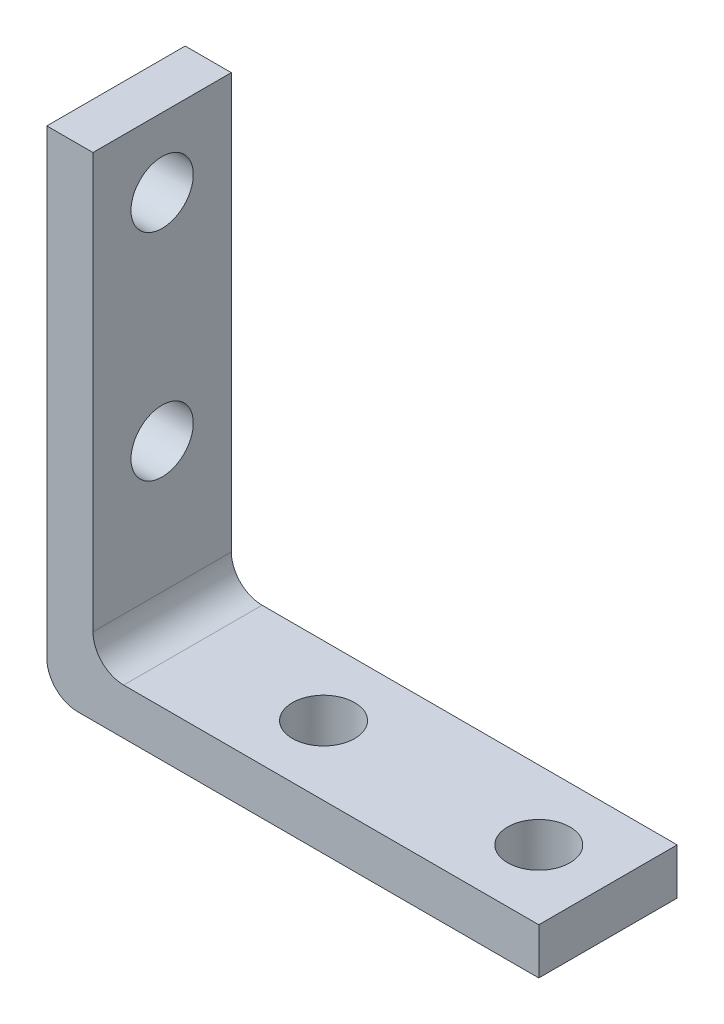
ISO-10303-21;
HEADER;
FILE_DESCRIPTION(('STEP AP214'),'2;1');
FILE_NAME('part.step','',(''),(''),'','','');
FILE_SCHEMA(('AUTOMOTIVE_DESIGN { 1 0 10303 214 1 1 1 1 }'));
ENDSEC;
DATA;
#1=APPLICATION_CONTEXT('core data for automotive mechanical design processes');
#2=APPLICATION_PROTOCOL_DEFINITION('international standard','automotive_design',2000,#1);
#3=PRODUCT_CONTEXT('',#1,'mechanical');
#4=PRODUCT('Part','Part','',(#3));
#5=PRODUCT_RELATED_PRODUCT_CATEGORY('part','',(#4));
#6=PRODUCT_DEFINITION_FORMATION('','',#4);
#7=PRODUCT_DEFINITION_CONTEXT('part definition',#1,'design');
#8=PRODUCT_DEFINITION('design','',#6,#7);
#9=PRODUCT_DEFINITION_SHAPE('','',#8);
#10=(LENGTH_UNIT() NAMED_UNIT(*) SI_UNIT(.MILLI.,.METRE.));
#11=(NAMED_UNIT(*) PLANE_ANGLE_UNIT() SI_UNIT($,.RADIAN.));
#12=(NAMED_UNIT(*) SI_UNIT($,.STERADIAN.) SOLID_ANGLE_UNIT());
#13=UNCERTAINTY_MEASURE_WITH_UNIT(LENGTH_MEASURE(1.E-05),#10,'distance_accuracy_value','');
#14=(GEOMETRIC_REPRESENTATION_CONTEXT(3) GLOBAL_UNCERTAINTY_ASSIGNED_CONTEXT((#13)) GLOBAL_UNIT_ASSIGNED_CONTEXT((#10,
#11,#12)) REPRESENTATION_CONTEXT('',''));
#15=CARTESIAN_POINT('',(0.,0.,0.));
#16=DIRECTION('',(0.,0.,1.));
#17=DIRECTION('',(1.,0.,0.));
#18=AXIS2_PLACEMENT_3D('',#15,#16,#17);
#19=CARTESIAN_POINT('',(0.,0.,4.5));
#20=DIRECTION('',(-1.,0.,0.));
#21=DIRECTION('',(0.,0.,1.));
#22=AXIS2_PLACEMENT_3D('',#19,#20,#21);
#23=PLANE('',#22);
#24=CARTESIAN_POINT('',(0.,27.5,0.));
#25=DIRECTION('',(-1.,0.,0.));
#26=DIRECTION('',(0.,0.,1.));
#27=AXIS2_PLACEMENT_3D('',#24,#25,#26);
#28=CIRCLE('',#27,2.025);
#29=CARTESIAN_POINT('',(0.,27.5,2.025));
#30=VERTEX_POINT('',#29);
#31=EDGE_CURVE('E192',#30,#30,#28,.T.);
#32=ORIENTED_EDGE('',*,*,#31,.F.);
#33=EDGE_LOOP('',(#32));
#34=FACE_BOUND('',#33,.T.);
#35=CARTESIAN_POINT('',(0.,13.5,0.));
#36=DIRECTION('',(-1.,0.,0.));
#37=DIRECTION('',(0.,0.,1.));
#38=AXIS2_PLACEMENT_3D('',#35,#36,#37);
#39=CIRCLE('',#38,2.025);
#40=CARTESIAN_POINT('',(0.,13.5,2.025));
#41=VERTEX_POINT('',#40);
#42=EDGE_CURVE('E285',#41,#41,#39,.T.);
#43=ORIENTED_EDGE('',*,*,#42,.F.);
#44=EDGE_LOOP('',(#43));
#45=FACE_BOUND('',#44,.T.);
#46=DIRECTION('',(0.,1.,0.));
#47=VECTOR('',#46,1.);
#48=CARTESIAN_POINT('',(0.,0.,-4.5));
#49=LINE('',#48,#47);
#50=CARTESIAN_POINT('',(0.,2.,-4.5));
#51=VERTEX_POINT('',#50);
#52=CARTESIAN_POINT('',(0.,32.,-4.5));
#53=VERTEX_POINT('',#52);
#54=EDGE_CURVE('E152',#51,#53,#49,.T.);
#55=ORIENTED_EDGE('',*,*,#54,.F.);
#56=DIRECTION('',(0.,0.,-1.));
#57=VECTOR('',#56,1.);
#58=CARTESIAN_POINT('',(0.,2.,4.5));
#59=LINE('',#58,#57);
#60=CARTESIAN_POINT('',(0.,2.,4.5));
#61=VERTEX_POINT('',#60);
#62=EDGE_CURVE('E58',#51,#61,#59,.F.);
#63=ORIENTED_EDGE('',*,*,#62,.T.);
#64=DIRECTION('',(0.,1.,0.));
#65=VECTOR('',#64,1.);
#66=CARTESIAN_POINT('',(0.,0.,4.5));
#67=LINE('',#66,#65);
#68=CARTESIAN_POINT('',(0.,32.,4.5));
#69=VERTEX_POINT('',#68);
#70=EDGE_CURVE('E120',#61,#69,#67,.T.);
#71=ORIENTED_EDGE('',*,*,#70,.T.);
#72=DIRECTION('',(0.,0.,-1.));
#73=VECTOR('',#72,1.);
#74=CARTESIAN_POINT('',(0.,32.,4.5));
#75=LINE('',#74,#73);
#76=EDGE_CURVE('E151',#69,#53,#75,.T.);
#77=ORIENTED_EDGE('',*,*,#76,.T.);
#78=EDGE_LOOP('',(#55,#63,#71,#77));
#79=FACE_BOUND('',#78,.T.);
#80=ADVANCED_FACE('F42',(#34,#45,#79),#23,.T.);
#81=CARTESIAN_POINT('',(0.,0.,4.5));
#82=DIRECTION('',(0.,1.,0.));
#83=DIRECTION('',(0.,0.,1.));
#84=AXIS2_PLACEMENT_3D('',#81,#82,#83);
#85=PLANE('',#84);
#86=CARTESIAN_POINT('',(13.5,0.,0.));
#87=DIRECTION('',(0.,-1.,0.));
#88=DIRECTION('',(0.,0.,-1.));
#89=AXIS2_PLACEMENT_3D('',#86,#87,#88);
#90=CIRCLE('',#89,2.025);
#91=CARTESIAN_POINT('',(13.5,0.,-2.025));
#92=VERTEX_POINT('',#91);
#93=EDGE_CURVE('E184',#92,#92,#90,.T.);
#94=ORIENTED_EDGE('',*,*,#93,.F.);
#95=EDGE_LOOP('',(#94));
#96=FACE_BOUND('',#95,.T.);
#97=CARTESIAN_POINT('',(27.5,0.,0.));
#98=DIRECTION('',(0.,-1.,0.));
#99=DIRECTION('',(0.,0.,-1.));
#100=AXIS2_PLACEMENT_3D('',#97,#98,#99);
#101=CIRCLE('',#100,2.025);
#102=CARTESIAN_POINT('',(27.5,0.,-2.025));
#103=VERTEX_POINT('',#102);
#104=EDGE_CURVE('E196',#103,#103,#101,.T.);
#105=ORIENTED_EDGE('',*,*,#104,.F.);
#106=EDGE_LOOP('',(#105));
#107=FACE_BOUND('',#106,.T.);
#108=DIRECTION('',(1.,0.,0.));
#109=VECTOR('',#108,1.);
#110=CARTESIAN_POINT('',(0.,0.,4.5));
#111=LINE('',#110,#109);
#112=CARTESIAN_POINT('',(2.,0.,4.5));
#113=VERTEX_POINT('',#112);
#114=CARTESIAN_POINT('',(32.,0.,4.5));
#115=VERTEX_POINT('',#114);
#116=EDGE_CURVE('E107',#113,#115,#111,.T.);
#117=ORIENTED_EDGE('',*,*,#116,.F.);
#118=DIRECTION('',(0.,0.,-1.));
#119=VECTOR('',#118,1.);
#120=CARTESIAN_POINT('',(2.,0.,-4.5));
#121=LINE('',#120,#119);
#122=CARTESIAN_POINT('',(2.,0.,-4.5));
#123=VERTEX_POINT('',#122);
#124=EDGE_CURVE('E203',#113,#123,#121,.T.);
#125=ORIENTED_EDGE('',*,*,#124,.T.);
#126=DIRECTION('',(1.,0.,0.));
#127=VECTOR('',#126,1.);
#128=CARTESIAN_POINT('',(0.,0.,-4.5));
#129=LINE('',#128,#127);
#130=CARTESIAN_POINT('',(32.,0.,-4.5));
#131=VERTEX_POINT('',#130);
#132=EDGE_CURVE('E125',#123,#131,#129,.T.);
#133=ORIENTED_EDGE('',*,*,#132,.T.);
#134=DIRECTION('',(0.,0.,-1.));
#135=VECTOR('',#134,1.);
#136=CARTESIAN_POINT('',(32.,0.,4.5));
#137=LINE('',#136,#135);
#138=EDGE_CURVE('E123',#115,#131,#137,.T.);
#139=ORIENTED_EDGE('',*,*,#138,.F.);
#140=EDGE_LOOP('',(#117,#125,#133,#139));
#141=FACE_BOUND('',#140,.T.);
#142=ADVANCED_FACE('F124',(#96,#107,#141),#85,.F.);
#143=CARTESIAN_POINT('',(32.,0.,4.5));
#144=DIRECTION('',(-1.,0.,0.));
#145=DIRECTION('',(0.,0.,1.));
#146=AXIS2_PLACEMENT_3D('',#143,#144,#145);
#147=PLANE('',#146);
#148=DIRECTION('',(0.,1.,0.));
#149=VECTOR('',#148,1.);
#150=CARTESIAN_POINT('',(32.,0.,-4.5));
#151=LINE('',#150,#149);
#152=CARTESIAN_POINT('',(32.,3.,-4.5));
#153=VERTEX_POINT('',#152);
#154=EDGE_CURVE('E158',#131,#153,#151,.T.);
#155=ORIENTED_EDGE('',*,*,#154,.T.);
#156=DIRECTION('',(0.,0.,-1.));
#157=VECTOR('',#156,1.);
#158=CARTESIAN_POINT('',(32.,3.,4.5));
#159=LINE('',#158,#157);
#160=CARTESIAN_POINT('',(32.,3.,4.5));
#161=VERTEX_POINT('',#160);
#162=EDGE_CURVE('E131',#161,#153,#159,.T.);
#163=ORIENTED_EDGE('',*,*,#162,.F.);
#164=DIRECTION('',(0.,1.,0.));
#165=VECTOR('',#164,1.);
#166=CARTESIAN_POINT('',(32.,0.,4.5));
#167=LINE('',#166,#165);
#168=EDGE_CURVE('E112',#115,#161,#167,.T.);
#169=ORIENTED_EDGE('',*,*,#168,.F.);
#170=ORIENTED_EDGE('',*,*,#138,.T.);
#171=EDGE_LOOP('',(#155,#163,#169,#170));
#172=FACE_BOUND('',#171,.T.);
#173=ADVANCED_FACE('F133',(#172),#147,.F.);
#174=CARTESIAN_POINT('',(0.,3.,4.5));
#175=DIRECTION('',(0.,1.,0.));
#176=DIRECTION('',(0.,0.,1.));
#177=AXIS2_PLACEMENT_3D('',#174,#175,#176);
#178=PLANE('',#177);
#179=CARTESIAN_POINT('',(13.5,3.,0.));
#180=DIRECTION('',(0.,1.,0.));
#181=DIRECTION('',(0.,0.,1.));
#182=AXIS2_PLACEMENT_3D('',#179,#180,#181);
#183=CIRCLE('',#182,2.025);
#184=CARTESIAN_POINT('',(13.5,3.,2.025));
#185=VERTEX_POINT('',#184);
#186=EDGE_CURVE('E155',#185,#185,#183,.T.);
#187=ORIENTED_EDGE('',*,*,#186,.F.);
#188=EDGE_LOOP('',(#187));
#189=FACE_BOUND('',#188,.T.);
#190=CARTESIAN_POINT('',(27.5,3.,0.));
#191=DIRECTION('',(0.,1.,0.));
#192=DIRECTION('',(0.,0.,1.));
#193=AXIS2_PLACEMENT_3D('',#190,#191,#192);
#194=CIRCLE('',#193,2.025);
#195=CARTESIAN_POINT('',(27.5,3.,2.025));
#196=VERTEX_POINT('',#195);
#197=EDGE_CURVE('E180',#196,#196,#194,.T.);
#198=ORIENTED_EDGE('',*,*,#197,.F.);
#199=EDGE_LOOP('',(#198));
#200=FACE_BOUND('',#199,.T.);
#201=DIRECTION('',(1.,0.,0.));
#202=VECTOR('',#201,1.);
#203=CARTESIAN_POINT('',(0.,3.,-4.5));
#204=LINE('',#203,#202);
#205=CARTESIAN_POINT('',(5.,3.,-4.5));
#206=VERTEX_POINT('',#205);
#207=EDGE_CURVE('E161',#206,#153,#204,.T.);
#208=ORIENTED_EDGE('',*,*,#207,.F.);
#209=DIRECTION('',(0.,0.,-1.));
#210=VECTOR('',#209,1.);
#211=CARTESIAN_POINT('',(5.,3.,4.5));
#212=LINE('',#211,#210);
#213=CARTESIAN_POINT('',(5.,3.,4.5));
#214=VERTEX_POINT('',#213);
#215=EDGE_CURVE('E200',#206,#214,#212,.F.);
#216=ORIENTED_EDGE('',*,*,#215,.T.);
#217=DIRECTION('',(1.,0.,0.));
#218=VECTOR('',#217,1.);
#219=CARTESIAN_POINT('',(0.,3.,4.5));
#220=LINE('',#219,#218);
#221=EDGE_CURVE('E136',#214,#161,#220,.T.);
#222=ORIENTED_EDGE('',*,*,#221,.T.);
#223=ORIENTED_EDGE('',*,*,#162,.T.);
#224=EDGE_LOOP('',(#208,#216,#222,#223));
#225=FACE_BOUND('',#224,.T.);
#226=ADVANCED_FACE('F219',(#189,#200,#225),#178,.T.);
#227=CARTESIAN_POINT('',(3.,0.,4.5));
#228=DIRECTION('',(-1.,0.,0.));
#229=DIRECTION('',(0.,0.,1.));
#230=AXIS2_PLACEMENT_3D('',#227,#228,#229);
#231=PLANE('',#230);
#232=CARTESIAN_POINT('',(3.,27.5,0.));
#233=DIRECTION('',(-1.,0.,0.));
#234=DIRECTION('',(0.,0.,1.));
#235=AXIS2_PLACEMENT_3D('',#232,#233,#234);
#236=CIRCLE('',#235,2.025);
#237=CARTESIAN_POINT('',(3.,27.5,2.025));
#238=VERTEX_POINT('',#237);
#239=EDGE_CURVE('E191',#238,#238,#236,.T.);
#240=ORIENTED_EDGE('',*,*,#239,.T.);
#241=EDGE_LOOP('',(#240));
#242=FACE_BOUND('',#241,.T.);
#243=CARTESIAN_POINT('',(3.,13.5,0.));
#244=DIRECTION('',(-1.,0.,0.));
#245=DIRECTION('',(0.,0.,1.));
#246=AXIS2_PLACEMENT_3D('',#243,#244,#245);
#247=CIRCLE('',#246,2.025);
#248=CARTESIAN_POINT('',(3.,13.5,2.025));
#249=VERTEX_POINT('',#248);
#250=EDGE_CURVE('E188',#249,#249,#247,.T.);
#251=ORIENTED_EDGE('',*,*,#250,.T.);
#252=EDGE_LOOP('',(#251));
#253=FACE_BOUND('',#252,.T.);
#254=DIRECTION('',(0.,1.,0.));
#255=VECTOR('',#254,1.);
#256=CARTESIAN_POINT('',(3.,0.,4.5));
#257=LINE('',#256,#255);
#258=CARTESIAN_POINT('',(3.,5.,4.5));
#259=VERTEX_POINT('',#258);
#260=CARTESIAN_POINT('',(3.,32.,4.5));
#261=VERTEX_POINT('',#260);
#262=EDGE_CURVE('E141',#259,#261,#257,.T.);
#263=ORIENTED_EDGE('',*,*,#262,.F.);
#264=DIRECTION('',(0.,0.,-1.));
#265=VECTOR('',#264,1.);
#266=CARTESIAN_POINT('',(3.,5.,4.5));
#267=LINE('',#266,#265);
#268=CARTESIAN_POINT('',(3.,5.,-4.5));
#269=VERTEX_POINT('',#268);
#270=EDGE_CURVE('E130',#259,#269,#267,.T.);
#271=ORIENTED_EDGE('',*,*,#270,.T.);
#272=DIRECTION('',(0.,1.,0.));
#273=VECTOR('',#272,1.);
#274=CARTESIAN_POINT('',(3.,0.,-4.5));
#275=LINE('',#274,#273);
#276=CARTESIAN_POINT('',(3.,32.,-4.5));
#277=VERTEX_POINT('',#276);
#278=EDGE_CURVE('E164',#269,#277,#275,.T.);
#279=ORIENTED_EDGE('',*,*,#278,.T.);
#280=DIRECTION('',(0.,0.,-1.));
#281=VECTOR('',#280,1.);
#282=CARTESIAN_POINT('',(3.,32.,4.5));
#283=LINE('',#282,#281);
#284=EDGE_CURVE('E174',#261,#277,#283,.T.);
#285=ORIENTED_EDGE('',*,*,#284,.F.);
#286=EDGE_LOOP('',(#263,#271,#279,#285));
#287=FACE_BOUND('',#286,.T.);
#288=ADVANCED_FACE('F226',(#242,#253,#287),#231,.F.);
#289=CARTESIAN_POINT('',(0.,32.,4.5));
#290=DIRECTION('',(0.,1.,0.));
#291=DIRECTION('',(0.,0.,1.));
#292=AXIS2_PLACEMENT_3D('',#289,#290,#291);
#293=PLANE('',#292);
#294=DIRECTION('',(1.,0.,0.));
#295=VECTOR('',#294,1.);
#296=CARTESIAN_POINT('',(0.,32.,-4.5));
#297=LINE('',#296,#295);
#298=EDGE_CURVE('E167',#53,#277,#297,.T.);
#299=ORIENTED_EDGE('',*,*,#298,.F.);
#300=ORIENTED_EDGE('',*,*,#76,.F.);
#301=DIRECTION('',(1.,0.,0.));
#302=VECTOR('',#301,1.);
#303=CARTESIAN_POINT('',(0.,32.,4.5));
#304=LINE('',#303,#302);
#305=EDGE_CURVE('E147',#69,#261,#304,.T.);
#306=ORIENTED_EDGE('',*,*,#305,.T.);
#307=ORIENTED_EDGE('',*,*,#284,.T.);
#308=EDGE_LOOP('',(#299,#300,#306,#307));
#309=FACE_BOUND('',#308,.T.);
#310=ADVANCED_FACE('F230',(#309),#293,.T.);
#311=CARTESIAN_POINT('',(0.,0.,4.5));
#312=DIRECTION('',(0.,0.,1.));
#313=DIRECTION('',(1.,0.,0.));
#314=AXIS2_PLACEMENT_3D('',#311,#312,#313);
#315=PLANE('',#314);
#316=ORIENTED_EDGE('',*,*,#70,.F.);
#317=CARTESIAN_POINT('',(2.,2.,4.5));
#318=DIRECTION('',(0.,0.,1.));
#319=DIRECTION('',(1.,0.,0.));
#320=AXIS2_PLACEMENT_3D('',#317,#318,#319);
#321=CIRCLE('',#320,2.);
#322=EDGE_CURVE('E115',#61,#113,#321,.T.);
#323=ORIENTED_EDGE('',*,*,#322,.T.);
#324=ORIENTED_EDGE('',*,*,#116,.T.);
#325=ORIENTED_EDGE('',*,*,#168,.T.);
#326=ORIENTED_EDGE('',*,*,#221,.F.);
#327=CARTESIAN_POINT('',(5.,5.,4.5));
#328=DIRECTION('',(0.,0.,1.));
#329=DIRECTION('',(1.,0.,0.));
#330=AXIS2_PLACEMENT_3D('',#327,#328,#329);
#331=CIRCLE('',#330,2.);
#332=EDGE_CURVE('E11',#214,#259,#331,.F.);
#333=ORIENTED_EDGE('',*,*,#332,.T.);
#334=ORIENTED_EDGE('',*,*,#262,.T.);
#335=ORIENTED_EDGE('',*,*,#305,.F.);
#336=EDGE_LOOP('',(#316,#323,#324,#325,#326,#333,#334,#335));
#337=FACE_BOUND('',#336,.T.);
#338=ADVANCED_FACE('F109',(#337),#315,.T.);
#339=CARTESIAN_POINT('',(0.,0.,-4.5));
#340=DIRECTION('',(0.,0.,1.));
#341=DIRECTION('',(1.,0.,0.));
#342=AXIS2_PLACEMENT_3D('',#339,#340,#341);
#343=PLANE('',#342);
#344=ORIENTED_EDGE('',*,*,#132,.F.);
#345=CARTESIAN_POINT('',(2.,2.,-4.5));
#346=DIRECTION('',(0.,0.,1.));
#347=DIRECTION('',(1.,0.,0.));
#348=AXIS2_PLACEMENT_3D('',#345,#346,#347);
#349=CIRCLE('',#348,2.);
#350=EDGE_CURVE('E66',#123,#51,#349,.F.);
#351=ORIENTED_EDGE('',*,*,#350,.T.);
#352=ORIENTED_EDGE('',*,*,#54,.T.);
#353=ORIENTED_EDGE('',*,*,#298,.T.);
#354=ORIENTED_EDGE('',*,*,#278,.F.);
#355=CARTESIAN_POINT('',(5.,5.,-4.5));
#356=DIRECTION('',(0.,0.,1.));
#357=DIRECTION('',(1.,0.,0.));
#358=AXIS2_PLACEMENT_3D('',#355,#356,#357);
#359=CIRCLE('',#358,2.);
#360=EDGE_CURVE('E51',#269,#206,#359,.T.);
#361=ORIENTED_EDGE('',*,*,#360,.T.);
#362=ORIENTED_EDGE('',*,*,#207,.T.);
#363=ORIENTED_EDGE('',*,*,#154,.F.);
#364=EDGE_LOOP('',(#344,#351,#352,#353,#354,#361,#362,#363));
#365=FACE_BOUND('',#364,.T.);
#366=ADVANCED_FACE('F214',(#365),#343,.F.);
#367=CARTESIAN_POINT('',(27.5,9.,0.));
#368=DIRECTION('',(0.,-1.,0.));
#369=DIRECTION('',(0.,0.,-1.));
#370=AXIS2_PLACEMENT_3D('',#367,#368,#369);
#371=CYLINDRICAL_SURFACE('',#370,2.025);
#372=ORIENTED_EDGE('',*,*,#197,.T.);
#373=EDGE_LOOP('',(#372));
#374=FACE_BOUND('',#373,.T.);
#375=ORIENTED_EDGE('',*,*,#104,.T.);
#376=EDGE_LOOP('',(#375));
#377=FACE_BOUND('',#376,.T.);
#378=ADVANCED_FACE('F260',(#374,#377),#371,.F.);
#379=CARTESIAN_POINT('',(13.5,9.,0.));
#380=DIRECTION('',(0.,-1.,0.));
#381=DIRECTION('',(0.,0.,-1.));
#382=AXIS2_PLACEMENT_3D('',#379,#380,#381);
#383=CYLINDRICAL_SURFACE('',#382,2.025);
#384=ORIENTED_EDGE('',*,*,#186,.T.);
#385=EDGE_LOOP('',(#384));
#386=FACE_BOUND('',#385,.T.);
#387=ORIENTED_EDGE('',*,*,#93,.T.);
#388=EDGE_LOOP('',(#387));
#389=FACE_BOUND('',#388,.T.);
#390=ADVANCED_FACE('F265',(#386,#389),#383,.F.);
#391=CARTESIAN_POINT('',(9.,13.5,0.));
#392=DIRECTION('',(-1.,0.,0.));
#393=DIRECTION('',(0.,0.,1.));
#394=AXIS2_PLACEMENT_3D('',#391,#392,#393);
#395=CYLINDRICAL_SURFACE('',#394,2.025);
#396=ORIENTED_EDGE('',*,*,#42,.T.);
#397=EDGE_LOOP('',(#396));
#398=FACE_BOUND('',#397,.T.);
#399=ORIENTED_EDGE('',*,*,#250,.F.);
#400=EDGE_LOOP('',(#399));
#401=FACE_BOUND('',#400,.T.);
#402=ADVANCED_FACE('F269',(#398,#401),#395,.F.);
#403=CARTESIAN_POINT('',(9.,27.5,0.));
#404=DIRECTION('',(-1.,0.,0.));
#405=DIRECTION('',(0.,0.,1.));
#406=AXIS2_PLACEMENT_3D('',#403,#404,#405);
#407=CYLINDRICAL_SURFACE('',#406,2.025);
#408=ORIENTED_EDGE('',*,*,#31,.T.);
#409=EDGE_LOOP('',(#408));
#410=FACE_BOUND('',#409,.T.);
#411=ORIENTED_EDGE('',*,*,#239,.F.);
#412=EDGE_LOOP('',(#411));
#413=FACE_BOUND('',#412,.T.);
#414=ADVANCED_FACE('F236',(#410,#413),#407,.F.);
#415=CARTESIAN_POINT('',(5.,5.,4.5));
#416=DIRECTION('',(0.,0.,-1.));
#417=DIRECTION('',(-1.,0.,0.));
#418=AXIS2_PLACEMENT_3D('',#415,#416,#417);
#419=CYLINDRICAL_SURFACE('',#418,2.);
#420=ORIENTED_EDGE('',*,*,#332,.F.);
#421=ORIENTED_EDGE('',*,*,#215,.F.);
#422=ORIENTED_EDGE('',*,*,#360,.F.);
#423=ORIENTED_EDGE('',*,*,#270,.F.);
#424=EDGE_LOOP('',(#420,#421,#422,#423));
#425=FACE_BOUND('',#424,.T.);
#426=ADVANCED_FACE('F221',(#425),#419,.F.);
#427=CARTESIAN_POINT('',(2.,2.,4.5));
#428=DIRECTION('',(0.,0.,1.));
#429=DIRECTION('',(1.,0.,0.));
#430=AXIS2_PLACEMENT_3D('',#427,#428,#429);
#431=CYLINDRICAL_SURFACE('',#430,2.);
#432=ORIENTED_EDGE('',*,*,#322,.F.);
#433=ORIENTED_EDGE('',*,*,#62,.F.);
#434=ORIENTED_EDGE('',*,*,#350,.F.);
#435=ORIENTED_EDGE('',*,*,#124,.F.);
#436=EDGE_LOOP('',(#432,#433,#434,#435));
#437=FACE_BOUND('',#436,.T.);
#438=ADVANCED_FACE('F44',(#437),#431,.T.);
#439=CLOSED_SHELL('',(#80,#142,#173,#226,#288,#310,#338,#366,#378,#390,#402,#414,#426,#438));
#440=MANIFOLD_SOLID_BREP('B2',#439);
#441=ADVANCED_BREP_SHAPE_REPRESENTATION('',(#18,#440),#14);
#442=SHAPE_DEFINITION_REPRESENTATION(#9,#441);
ENDSEC;
END-ISO-10303-21;
